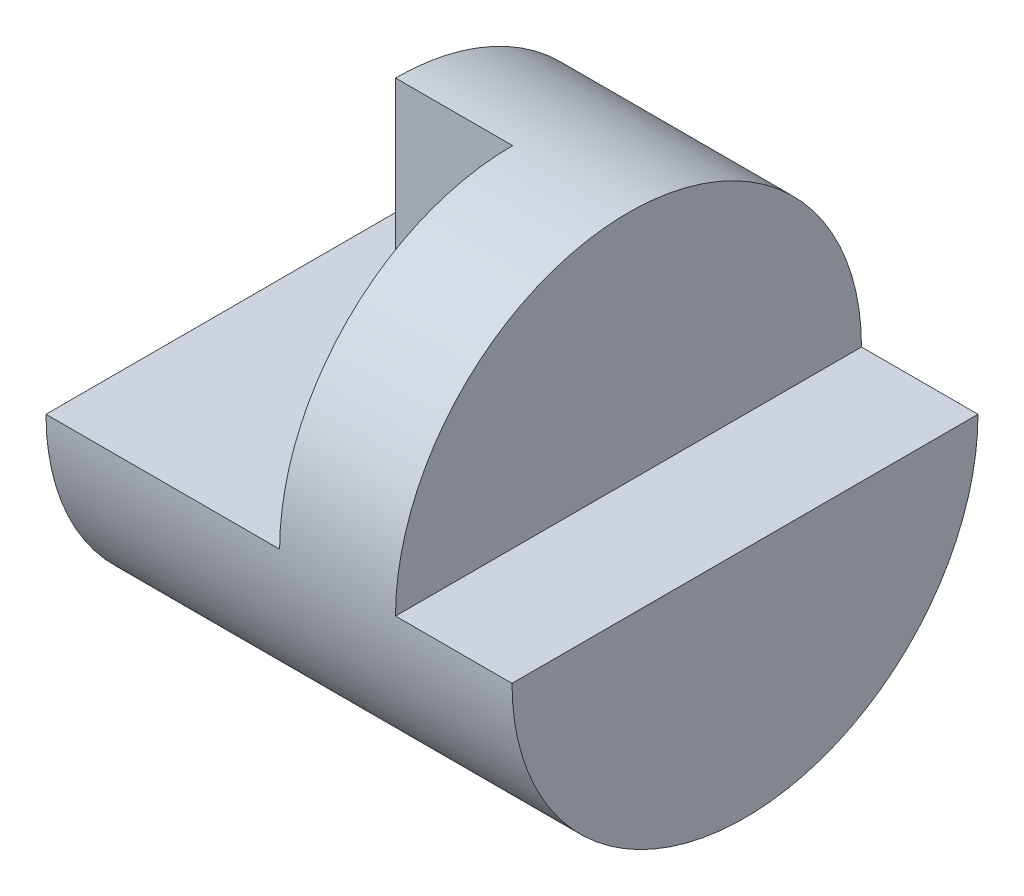
ISO-10303-21;
HEADER;
FILE_DESCRIPTION(('STEP AP214'),'2;1');
FILE_NAME('part.step','',(''),(''),'','','');
FILE_SCHEMA(('AUTOMOTIVE_DESIGN { 1 0 10303 214 1 1 1 1 }'));
ENDSEC;
DATA;
#1=APPLICATION_CONTEXT('core data for automotive mechanical design processes');
#2=APPLICATION_PROTOCOL_DEFINITION('international standard','automotive_design',2000,#1);
#3=PRODUCT_CONTEXT('',#1,'mechanical');
#4=PRODUCT('Part','Part','',(#3));
#5=PRODUCT_RELATED_PRODUCT_CATEGORY('part','',(#4));
#6=PRODUCT_DEFINITION_FORMATION('','',#4);
#7=PRODUCT_DEFINITION_CONTEXT('part definition',#1,'design');
#8=PRODUCT_DEFINITION('design','',#6,#7);
#9=PRODUCT_DEFINITION_SHAPE('','',#8);
#10=(LENGTH_UNIT() NAMED_UNIT(*) SI_UNIT(.MILLI.,.METRE.));
#11=(NAMED_UNIT(*) PLANE_ANGLE_UNIT() SI_UNIT($,.RADIAN.));
#12=(NAMED_UNIT(*) SI_UNIT($,.STERADIAN.) SOLID_ANGLE_UNIT());
#13=UNCERTAINTY_MEASURE_WITH_UNIT(LENGTH_MEASURE(1.E-05),#10,'distance_accuracy_value','');
#14=(GEOMETRIC_REPRESENTATION_CONTEXT(3) GLOBAL_UNCERTAINTY_ASSIGNED_CONTEXT((#13)) GLOBAL_UNIT_ASSIGNED_CONTEXT((#10,
#11,#12)) REPRESENTATION_CONTEXT('',''));
#15=CARTESIAN_POINT('',(0.,0.,0.));
#16=DIRECTION('',(0.,0.,1.));
#17=DIRECTION('',(1.,0.,0.));
#18=AXIS2_PLACEMENT_3D('',#15,#16,#17);
#19=CARTESIAN_POINT('',(0.,0.,0.));
#20=DIRECTION('',(-1.,0.,0.));
#21=DIRECTION('',(0.,0.,1.));
#22=AXIS2_PLACEMENT_3D('',#19,#20,#21);
#23=CYLINDRICAL_SURFACE('',#22,2.);
#24=CARTESIAN_POINT('',(3.,0.,0.));
#25=DIRECTION('',(-1.,0.,0.));
#26=DIRECTION('',(0.,-1.,0.));
#27=AXIS2_PLACEMENT_3D('',#24,#25,#26);
#28=CIRCLE('',#27,2.);
#29=CARTESIAN_POINT('',(3.,0.,-2.));
#30=VERTEX_POINT('',#29);
#31=CARTESIAN_POINT('',(3.,0.,2.));
#32=VERTEX_POINT('',#31);
#33=EDGE_CURVE('E126',#30,#32,#28,.F.);
#34=ORIENTED_EDGE('',*,*,#33,.F.);
#35=DIRECTION('',(-1.,0.,0.));
#36=VECTOR('',#35,1.);
#37=CARTESIAN_POINT('',(0.,0.,-2.));
#38=LINE('',#37,#36);
#39=CARTESIAN_POINT('',(4.,0.,-2.));
#40=VERTEX_POINT('',#39);
#41=EDGE_CURVE('E115',#30,#40,#38,.F.);
#42=ORIENTED_EDGE('',*,*,#41,.T.);
#43=CARTESIAN_POINT('',(4.,0.,0.));
#44=DIRECTION('',(-1.,0.,0.));
#45=DIRECTION('',(0.,0.,1.));
#46=AXIS2_PLACEMENT_3D('',#43,#44,#45);
#47=CIRCLE('',#46,2.);
#48=CARTESIAN_POINT('',(4.,0.,2.));
#49=VERTEX_POINT('',#48);
#50=EDGE_CURVE('E118',#40,#49,#47,.T.);
#51=ORIENTED_EDGE('',*,*,#50,.T.);
#52=DIRECTION('',(-1.,0.,0.));
#53=VECTOR('',#52,1.);
#54=CARTESIAN_POINT('',(0.,0.,2.));
#55=LINE('',#54,#53);
#56=EDGE_CURVE('E112',#49,#32,#55,.T.);
#57=ORIENTED_EDGE('',*,*,#56,.T.);
#58=EDGE_LOOP('',(#34,#42,#51,#57));
#59=FACE_BOUND('',#58,.T.);
#60=CARTESIAN_POINT('',(1.,0.,0.));
#61=DIRECTION('',(-1.,0.,0.));
#62=DIRECTION('',(0.,-1.,0.));
#63=AXIS2_PLACEMENT_3D('',#60,#61,#62);
#64=CIRCLE('',#63,2.);
#65=CARTESIAN_POINT('',(1.,0.,-2.));
#66=VERTEX_POINT('',#65);
#67=CARTESIAN_POINT('',(1.,2.,0.));
#68=VERTEX_POINT('',#67);
#69=EDGE_CURVE('E40',#66,#68,#64,.F.);
#70=ORIENTED_EDGE('',*,*,#69,.T.);
#71=DIRECTION('',(-1.,0.,0.));
#72=VECTOR('',#71,1.);
#73=CARTESIAN_POINT('',(0.,2.,0.));
#74=LINE('',#73,#72);
#75=CARTESIAN_POINT('',(2.00538109063942,2.,0.));
#76=VERTEX_POINT('',#75);
#77=EDGE_CURVE('E91',#68,#76,#74,.F.);
#78=ORIENTED_EDGE('',*,*,#77,.T.);
#79=CARTESIAN_POINT('',(2.00538109063942,0.,0.));
#80=DIRECTION('',(-1.,0.,0.));
#81=DIRECTION('',(0.,-1.,0.));
#82=AXIS2_PLACEMENT_3D('',#79,#80,#81);
#83=CIRCLE('',#82,2.);
#84=CARTESIAN_POINT('',(2.00538109063942,0.,2.));
#85=VERTEX_POINT('',#84);
#86=EDGE_CURVE('E11',#76,#85,#83,.F.);
#87=ORIENTED_EDGE('',*,*,#86,.T.);
#88=DIRECTION('',(-1.,0.,0.));
#89=VECTOR('',#88,1.);
#90=CARTESIAN_POINT('',(0.,0.,2.));
#91=LINE('',#90,#89);
#92=CARTESIAN_POINT('',(0.,0.,2.));
#93=VERTEX_POINT('',#92);
#94=EDGE_CURVE('E100',#93,#85,#91,.F.);
#95=ORIENTED_EDGE('',*,*,#94,.F.);
#96=CARTESIAN_POINT('',(0.,0.,0.));
#97=DIRECTION('',(-1.,0.,0.));
#98=DIRECTION('',(0.,0.,1.));
#99=AXIS2_PLACEMENT_3D('',#96,#97,#98);
#100=CIRCLE('',#99,2.);
#101=CARTESIAN_POINT('',(0.,0.,-2.));
#102=VERTEX_POINT('',#101);
#103=EDGE_CURVE('E121',#102,#93,#100,.T.);
#104=ORIENTED_EDGE('',*,*,#103,.F.);
#105=DIRECTION('',(-1.,0.,0.));
#106=VECTOR('',#105,1.);
#107=CARTESIAN_POINT('',(0.,0.,-2.));
#108=LINE('',#107,#106);
#109=EDGE_CURVE('E53',#66,#102,#108,.T.);
#110=ORIENTED_EDGE('',*,*,#109,.F.);
#111=EDGE_LOOP('',(#70,#78,#87,#95,#104,#110));
#112=FACE_BOUND('',#111,.T.);
#113=ADVANCED_FACE('F33',(#59,#112),#23,.T.);
#114=CARTESIAN_POINT('',(1.,0.,-5.5));
#115=DIRECTION('',(-1.,0.,0.));
#116=DIRECTION('',(0.,-1.,0.));
#117=AXIS2_PLACEMENT_3D('',#114,#115,#116);
#118=PLANE('',#117);
#119=DIRECTION('',(0.,0.,1.));
#120=VECTOR('',#119,1.);
#121=CARTESIAN_POINT('',(1.,0.,-5.5));
#122=LINE('',#121,#120);
#123=CARTESIAN_POINT('',(1.,0.,0.));
#124=VERTEX_POINT('',#123);
#125=EDGE_CURVE('E105',#66,#124,#122,.T.);
#126=ORIENTED_EDGE('',*,*,#125,.T.);
#127=DIRECTION('',(0.,-1.,0.));
#128=VECTOR('',#127,1.);
#129=CARTESIAN_POINT('',(1.,3.,0.));
#130=LINE('',#129,#128);
#131=EDGE_CURVE('E92',#68,#124,#130,.T.);
#132=ORIENTED_EDGE('',*,*,#131,.F.);
#133=ORIENTED_EDGE('',*,*,#69,.F.);
#134=EDGE_LOOP('',(#126,#132,#133));
#135=FACE_BOUND('',#134,.T.);
#136=ADVANCED_FACE('F133',(#135),#118,.T.);
#137=CARTESIAN_POINT('',(4.,0.,0.));
#138=DIRECTION('',(-1.,0.,0.));
#139=DIRECTION('',(0.,0.,1.));
#140=AXIS2_PLACEMENT_3D('',#137,#138,#139);
#141=PLANE('',#140);
#142=DIRECTION('',(0.,0.,-1.));
#143=VECTOR('',#142,1.);
#144=CARTESIAN_POINT('',(4.,0.,0.));
#145=LINE('',#144,#143);
#146=EDGE_CURVE('E124',#49,#40,#145,.T.);
#147=ORIENTED_EDGE('',*,*,#146,.F.);
#148=ORIENTED_EDGE('',*,*,#50,.F.);
#149=EDGE_LOOP('',(#147,#148));
#150=FACE_BOUND('',#149,.T.);
#151=ADVANCED_FACE('F135',(#150),#141,.F.);
#152=CARTESIAN_POINT('',(0.,-2.,0.));
#153=DIRECTION('',(1.,0.,0.));
#154=DIRECTION('',(0.,0.,-1.));
#155=AXIS2_PLACEMENT_3D('',#152,#153,#154);
#156=PLANE('',#155);
#157=ORIENTED_EDGE('',*,*,#103,.T.);
#158=DIRECTION('',(0.,0.,-1.));
#159=VECTOR('',#158,1.);
#160=CARTESIAN_POINT('',(0.,0.,0.));
#161=LINE('',#160,#159);
#162=EDGE_CURVE('E128',#93,#102,#161,.T.);
#163=ORIENTED_EDGE('',*,*,#162,.T.);
#164=EDGE_LOOP('',(#157,#163));
#165=FACE_BOUND('',#164,.T.);
#166=ADVANCED_FACE('F141',(#165),#156,.F.);
#167=CARTESIAN_POINT('',(0.,0.,-5.5));
#168=DIRECTION('',(0.,1.,0.));
#169=DIRECTION('',(-1.,0.,0.));
#170=AXIS2_PLACEMENT_3D('',#167,#168,#169);
#171=PLANE('',#170);
#172=DIRECTION('',(0.,0.,1.));
#173=VECTOR('',#172,1.);
#174=CARTESIAN_POINT('',(3.,0.,-5.5));
#175=LINE('',#174,#173);
#176=EDGE_CURVE('E109',#30,#32,#175,.T.);
#177=ORIENTED_EDGE('',*,*,#176,.T.);
#178=ORIENTED_EDGE('',*,*,#56,.F.);
#179=ORIENTED_EDGE('',*,*,#146,.T.);
#180=ORIENTED_EDGE('',*,*,#41,.F.);
#181=EDGE_LOOP('',(#177,#178,#179,#180));
#182=FACE_BOUND('',#181,.T.);
#183=ADVANCED_FACE('F148',(#182),#171,.T.);
#184=CARTESIAN_POINT('',(3.,0.,-5.5));
#185=DIRECTION('',(-1.,0.,0.));
#186=DIRECTION('',(0.,-1.,0.));
#187=AXIS2_PLACEMENT_3D('',#184,#185,#186);
#188=PLANE('',#187);
#189=ORIENTED_EDGE('',*,*,#176,.F.);
#190=ORIENTED_EDGE('',*,*,#33,.T.);
#191=EDGE_LOOP('',(#189,#190));
#192=FACE_BOUND('',#191,.T.);
#193=ADVANCED_FACE('F151',(#192),#188,.F.);
#194=CARTESIAN_POINT('',(0.,0.,-5.5));
#195=DIRECTION('',(0.,-1.,0.));
#196=DIRECTION('',(1.,0.,0.));
#197=AXIS2_PLACEMENT_3D('',#194,#195,#196);
#198=PLANE('',#197);
#199=ORIENTED_EDGE('',*,*,#94,.T.);
#200=DIRECTION('',(0.,0.,-1.));
#201=VECTOR('',#200,1.);
#202=CARTESIAN_POINT('',(2.00538109063942,0.,0.));
#203=LINE('',#202,#201);
#204=CARTESIAN_POINT('',(2.00538109063942,0.,0.));
#205=VERTEX_POINT('',#204);
#206=EDGE_CURVE('E88',#85,#205,#203,.T.);
#207=ORIENTED_EDGE('',*,*,#206,.T.);
#208=DIRECTION('',(-1.,0.,0.));
#209=VECTOR('',#208,1.);
#210=CARTESIAN_POINT('',(2.00538109063942,0.,0.));
#211=LINE('',#210,#209);
#212=EDGE_CURVE('E47',#205,#124,#211,.T.);
#213=ORIENTED_EDGE('',*,*,#212,.T.);
#214=ORIENTED_EDGE('',*,*,#125,.F.);
#215=ORIENTED_EDGE('',*,*,#109,.T.);
#216=ORIENTED_EDGE('',*,*,#162,.F.);
#217=EDGE_LOOP('',(#199,#207,#213,#214,#215,#216));
#218=FACE_BOUND('',#217,.T.);
#219=ADVANCED_FACE('F98',(#218),#198,.F.);
#220=CARTESIAN_POINT('',(2.00538109063942,3.,0.));
#221=DIRECTION('',(-1.,0.,0.));
#222=DIRECTION('',(0.,-1.,0.));
#223=AXIS2_PLACEMENT_3D('',#220,#221,#222);
#224=PLANE('',#223);
#225=DIRECTION('',(0.,-1.,0.));
#226=VECTOR('',#225,1.);
#227=CARTESIAN_POINT('',(2.00538109063942,3.,0.));
#228=LINE('',#227,#226);
#229=EDGE_CURVE('E86',#76,#205,#228,.T.);
#230=ORIENTED_EDGE('',*,*,#229,.T.);
#231=ORIENTED_EDGE('',*,*,#206,.F.);
#232=ORIENTED_EDGE('',*,*,#86,.F.);
#233=EDGE_LOOP('',(#230,#231,#232));
#234=FACE_BOUND('',#233,.T.);
#235=ADVANCED_FACE('F87',(#234),#224,.T.);
#236=CARTESIAN_POINT('',(2.00538109063942,3.,0.));
#237=DIRECTION('',(0.,0.,1.));
#238=DIRECTION('',(1.,0.,0.));
#239=AXIS2_PLACEMENT_3D('',#236,#237,#238);
#240=PLANE('',#239);
#241=ORIENTED_EDGE('',*,*,#131,.T.);
#242=ORIENTED_EDGE('',*,*,#212,.F.);
#243=ORIENTED_EDGE('',*,*,#229,.F.);
#244=ORIENTED_EDGE('',*,*,#77,.F.);
#245=EDGE_LOOP('',(#241,#242,#243,#244));
#246=FACE_BOUND('',#245,.T.);
#247=ADVANCED_FACE('F94',(#246),#240,.T.);
#248=CLOSED_SHELL('',(#113,#136,#151,#166,#183,#193,#219,#235,#247));
#249=MANIFOLD_SOLID_BREP('B2',#248);
#250=ADVANCED_BREP_SHAPE_REPRESENTATION('',(#18,#249),#14);
#251=SHAPE_DEFINITION_REPRESENTATION(#9,#250);
ENDSEC;
END-ISO-10303-21;
